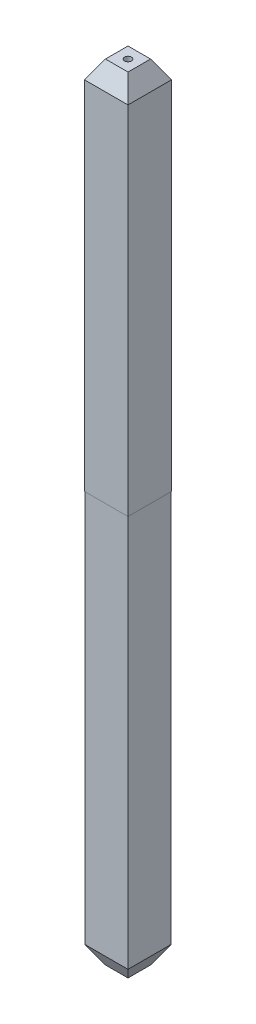
ISO-10303-21;
HEADER;
FILE_DESCRIPTION(('STEP AP214'),'2;1');
FILE_NAME('part.step','',(''),(''),'','','');
FILE_SCHEMA(('AUTOMOTIVE_DESIGN { 1 0 10303 214 1 1 1 1 }'));
ENDSEC;
DATA;
#1=APPLICATION_CONTEXT('core data for automotive mechanical design processes');
#2=APPLICATION_PROTOCOL_DEFINITION('international standard','automotive_design',2000,#1);
#3=PRODUCT_CONTEXT('',#1,'mechanical');
#4=PRODUCT('Part','Part','',(#3));
#5=PRODUCT_RELATED_PRODUCT_CATEGORY('part','',(#4));
#6=PRODUCT_DEFINITION_FORMATION('','',#4);
#7=PRODUCT_DEFINITION_CONTEXT('part definition',#1,'design');
#8=PRODUCT_DEFINITION('design','',#6,#7);
#9=PRODUCT_DEFINITION_SHAPE('','',#8);
#10=(LENGTH_UNIT() NAMED_UNIT(*) SI_UNIT(.MILLI.,.METRE.));
#11=(NAMED_UNIT(*) PLANE_ANGLE_UNIT() SI_UNIT($,.RADIAN.));
#12=(NAMED_UNIT(*) SI_UNIT($,.STERADIAN.) SOLID_ANGLE_UNIT());
#13=UNCERTAINTY_MEASURE_WITH_UNIT(LENGTH_MEASURE(1.E-05),#10,'distance_accuracy_value','');
#14=(GEOMETRIC_REPRESENTATION_CONTEXT(3) GLOBAL_UNCERTAINTY_ASSIGNED_CONTEXT((#13)) GLOBAL_UNIT_ASSIGNED_CONTEXT((#10,
#11,#12)) REPRESENTATION_CONTEXT('',''));
#15=CARTESIAN_POINT('',(0.,0.,0.));
#16=DIRECTION('',(0.,0.,1.));
#17=DIRECTION('',(1.,0.,0.));
#18=AXIS2_PLACEMENT_3D('',#15,#16,#17);
#19=CARTESIAN_POINT('',(-0.0766003527351416,-0.5,0.0186429872590637));
#20=DIRECTION('',(0.,1.,0.));
#21=DIRECTION('',(-1.,0.,0.));
#22=AXIS2_PLACEMENT_3D('',#19,#20,#21);
#23=PLANE('',#22);
#24=CARTESIAN_POINT('',(0.,-0.5,0.));
#25=DIRECTION('',(0.,1.,0.));
#26=DIRECTION('',(-1.,0.,0.));
#27=AXIS2_PLACEMENT_3D('',#24,#25,#26);
#28=CIRCLE('',#27,0.05);
#29=CARTESIAN_POINT('',(-0.05,-0.5,0.));
#30=VERTEX_POINT('',#29);
#31=EDGE_CURVE('E20',#30,#30,#28,.T.);
#32=ORIENTED_EDGE('',*,*,#31,.T.);
#33=EDGE_LOOP('',(#32));
#34=FACE_BOUND('',#33,.T.);
#35=ADVANCED_FACE('F17',(#34),#23,.T.);
#36=CARTESIAN_POINT('',(0.,0.,0.));
#37=DIRECTION('',(0.,1.,0.));
#38=DIRECTION('',(-1.,0.,0.));
#39=AXIS2_PLACEMENT_3D('',#36,#37,#38);
#40=CYLINDRICAL_SURFACE('',#39,0.05);
#41=CARTESIAN_POINT('',(0.,0.,0.));
#42=DIRECTION('',(0.,1.,0.));
#43=DIRECTION('',(-1.,0.,0.));
#44=AXIS2_PLACEMENT_3D('',#41,#42,#43);
#45=CIRCLE('',#44,0.05);
#46=CARTESIAN_POINT('',(-0.05,0.,0.));
#47=VERTEX_POINT('',#46);
#48=EDGE_CURVE('E115',#47,#47,#45,.T.);
#49=ORIENTED_EDGE('',*,*,#48,.T.);
#50=EDGE_LOOP('',(#49));
#51=FACE_BOUND('',#50,.T.);
#52=ORIENTED_EDGE('',*,*,#31,.F.);
#53=EDGE_LOOP('',(#52));
#54=FACE_BOUND('',#53,.T.);
#55=ADVANCED_FACE('F422',(#51,#54),#40,.F.);
#56=CARTESIAN_POINT('',(-0.165,0.,0.3175));
#57=DIRECTION('',(-0.866025403784429,0.500000000000017,0.));
#58=DIRECTION('',(-0.500000000000017,-0.866025403784429,0.));
#59=AXIS2_PLACEMENT_3D('',#56,#57,#58);
#60=PLANE('',#59);
#61=DIRECTION('',(0.,0.,1.));
#62=VECTOR('',#61,1.);
#63=CARTESIAN_POINT('',(-0.3175,-0.2641377481543,0.3175));
#64=LINE('',#63,#62);
#65=CARTESIAN_POINT('',(-0.317500000000013,-0.264137748154289,0.317500000000006));
#66=VERTEX_POINT('',#65);
#67=CARTESIAN_POINT('',(-0.317500000000013,-0.264137748154291,-0.317500000000003));
#68=VERTEX_POINT('',#67);
#69=EDGE_CURVE('E135',#66,#68,#64,.F.);
#70=ORIENTED_EDGE('',*,*,#69,.F.);
#71=DIRECTION('',(-0.447213595499911,-0.774596669241495,0.447213595499985));
#72=VECTOR('',#71,1.);
#73=CARTESIAN_POINT('',(-0.165,0.,0.165));
#74=LINE('',#73,#72);
#75=CARTESIAN_POINT('',(-0.165,0.,0.165));
#76=VERTEX_POINT('',#75);
#77=EDGE_CURVE('E114',#76,#66,#74,.T.);
#78=ORIENTED_EDGE('',*,*,#77,.F.);
#79=DIRECTION('',(0.,0.,-1.));
#80=VECTOR('',#79,1.);
#81=CARTESIAN_POINT('',(-0.165,0.,0.));
#82=LINE('',#81,#80);
#83=CARTESIAN_POINT('',(-0.165,0.,-0.165));
#84=VERTEX_POINT('',#83);
#85=EDGE_CURVE('E104',#76,#84,#82,.T.);
#86=ORIENTED_EDGE('',*,*,#85,.T.);
#87=DIRECTION('',(0.447213595499911,0.774596669241495,0.447213595499985));
#88=VECTOR('',#87,1.);
#89=CARTESIAN_POINT('',(-0.3175,-0.264137748154286,-0.317500000000025));
#90=LINE('',#89,#88);
#91=EDGE_CURVE('E112',#68,#84,#90,.T.);
#92=ORIENTED_EDGE('',*,*,#91,.F.);
#93=EDGE_LOOP('',(#70,#78,#86,#92));
#94=FACE_BOUND('',#93,.T.);
#95=ADVANCED_FACE('F111',(#94),#60,.T.);
#96=CARTESIAN_POINT('',(0.,0.,0.));
#97=DIRECTION('',(0.,-1.,0.));
#98=DIRECTION('',(0.,0.,-1.));
#99=AXIS2_PLACEMENT_3D('',#96,#97,#98);
#100=PLANE('',#99);
#101=ORIENTED_EDGE('',*,*,#48,.F.);
#102=EDGE_LOOP('',(#101));
#103=FACE_BOUND('',#102,.T.);
#104=DIRECTION('',(1.,0.,0.));
#105=VECTOR('',#104,1.);
#106=CARTESIAN_POINT('',(-0.3175,0.,-0.165));
#107=LINE('',#106,#105);
#108=CARTESIAN_POINT('',(0.165,0.,-0.165));
#109=VERTEX_POINT('',#108);
#110=EDGE_CURVE('E120',#84,#109,#107,.T.);
#111=ORIENTED_EDGE('',*,*,#110,.F.);
#112=ORIENTED_EDGE('',*,*,#85,.F.);
#113=DIRECTION('',(1.,0.,0.));
#114=VECTOR('',#113,1.);
#115=CARTESIAN_POINT('',(0.3175,0.,0.165));
#116=LINE('',#115,#114);
#117=CARTESIAN_POINT('',(0.165,0.,0.165));
#118=VERTEX_POINT('',#117);
#119=EDGE_CURVE('E123',#118,#76,#116,.F.);
#120=ORIENTED_EDGE('',*,*,#119,.F.);
#121=DIRECTION('',(0.,0.,1.));
#122=VECTOR('',#121,1.);
#123=CARTESIAN_POINT('',(0.165,0.,-0.3175));
#124=LINE('',#123,#122);
#125=EDGE_CURVE('E127',#109,#118,#124,.T.);
#126=ORIENTED_EDGE('',*,*,#125,.F.);
#127=EDGE_LOOP('',(#111,#112,#120,#126));
#128=FACE_BOUND('',#127,.T.);
#129=ADVANCED_FACE('F126',(#103,#128),#100,.F.);
#130=CARTESIAN_POINT('',(-0.3175,0.,-0.165));
#131=DIRECTION('',(0.,0.500000000000017,-0.866025403784429));
#132=DIRECTION('',(0.,0.866025403784429,0.500000000000017));
#133=AXIS2_PLACEMENT_3D('',#130,#131,#132);
#134=PLANE('',#133);
#135=DIRECTION('',(-1.,0.,0.));
#136=VECTOR('',#135,1.);
#137=CARTESIAN_POINT('',(-0.3175,-0.2641377481543,-0.3175));
#138=LINE('',#137,#136);
#139=CARTESIAN_POINT('',(0.317500000000003,-0.264137748154291,-0.317500000000013));
#140=VERTEX_POINT('',#139);
#141=EDGE_CURVE('E122',#68,#140,#138,.F.);
#142=ORIENTED_EDGE('',*,*,#141,.F.);
#143=ORIENTED_EDGE('',*,*,#91,.T.);
#144=ORIENTED_EDGE('',*,*,#110,.T.);
#145=DIRECTION('',(-0.447213595499985,0.774596669241495,0.447213595499911));
#146=VECTOR('',#145,1.);
#147=CARTESIAN_POINT('',(0.317500000000025,-0.264137748154286,-0.3175));
#148=LINE('',#147,#146);
#149=EDGE_CURVE('E146',#140,#109,#148,.T.);
#150=ORIENTED_EDGE('',*,*,#149,.F.);
#151=EDGE_LOOP('',(#142,#143,#144,#150));
#152=FACE_BOUND('',#151,.T.);
#153=ADVANCED_FACE('F118',(#152),#134,.T.);
#154=CARTESIAN_POINT('',(0.3175,0.,0.165));
#155=DIRECTION('',(0.,0.500000000000017,0.866025403784429));
#156=DIRECTION('',(0.,-0.866025403784429,0.500000000000017));
#157=AXIS2_PLACEMENT_3D('',#154,#155,#156);
#158=PLANE('',#157);
#159=DIRECTION('',(1.,0.,0.));
#160=VECTOR('',#159,1.);
#161=CARTESIAN_POINT('',(0.3175,-0.2641377481543,0.3175));
#162=LINE('',#161,#160);
#163=CARTESIAN_POINT('',(0.317500000000006,-0.264137748154289,0.317500000000013));
#164=VERTEX_POINT('',#163);
#165=EDGE_CURVE('E150',#164,#66,#162,.F.);
#166=ORIENTED_EDGE('',*,*,#165,.F.);
#167=DIRECTION('',(0.447213595499985,-0.774596669241495,0.447213595499911));
#168=VECTOR('',#167,1.);
#169=CARTESIAN_POINT('',(0.165,0.,0.165));
#170=LINE('',#169,#168);
#171=EDGE_CURVE('E144',#118,#164,#170,.T.);
#172=ORIENTED_EDGE('',*,*,#171,.F.);
#173=ORIENTED_EDGE('',*,*,#119,.T.);
#174=ORIENTED_EDGE('',*,*,#77,.T.);
#175=EDGE_LOOP('',(#166,#172,#173,#174));
#176=FACE_BOUND('',#175,.T.);
#177=ADVANCED_FACE('F390',(#176),#158,.T.);
#178=CARTESIAN_POINT('',(-0.3175,0.,0.3175));
#179=DIRECTION('',(-1.,0.,0.));
#180=DIRECTION('',(0.,0.,1.));
#181=AXIS2_PLACEMENT_3D('',#178,#179,#180);
#182=PLANE('',#181);
#183=ORIENTED_EDGE('',*,*,#69,.T.);
#184=DIRECTION('',(0.,1.,0.));
#185=VECTOR('',#184,1.);
#186=CARTESIAN_POINT('',(-0.3175,0.,-0.3175));
#187=LINE('',#186,#185);
#188=CARTESIAN_POINT('',(-0.3175,-5.48,-0.3175));
#189=VERTEX_POINT('',#188);
#190=EDGE_CURVE('E139',#189,#68,#187,.T.);
#191=ORIENTED_EDGE('',*,*,#190,.F.);
#192=DIRECTION('',(0.,0.,1.));
#193=VECTOR('',#192,1.);
#194=CARTESIAN_POINT('',(-0.3175,-5.48,0.3175));
#195=LINE('',#194,#193);
#196=CARTESIAN_POINT('',(-0.3175,-5.48,0.3175));
#197=VERTEX_POINT('',#196);
#198=EDGE_CURVE('E133',#189,#197,#195,.T.);
#199=ORIENTED_EDGE('',*,*,#198,.T.);
#200=DIRECTION('',(0.,1.,0.));
#201=VECTOR('',#200,1.);
#202=CARTESIAN_POINT('',(-0.3175,0.,0.3175));
#203=LINE('',#202,#201);
#204=EDGE_CURVE('E153',#66,#197,#203,.F.);
#205=ORIENTED_EDGE('',*,*,#204,.F.);
#206=EDGE_LOOP('',(#183,#191,#199,#205));
#207=FACE_BOUND('',#206,.T.);
#208=ADVANCED_FACE('F381',(#207),#182,.T.);
#209=CARTESIAN_POINT('',(-0.3175,0.,-0.3175));
#210=DIRECTION('',(0.,0.,-1.));
#211=DIRECTION('',(-1.,0.,0.));
#212=AXIS2_PLACEMENT_3D('',#209,#210,#211);
#213=PLANE('',#212);
#214=ORIENTED_EDGE('',*,*,#141,.T.);
#215=DIRECTION('',(0.,1.,0.));
#216=VECTOR('',#215,1.);
#217=CARTESIAN_POINT('',(0.3175,0.,-0.3175));
#218=LINE('',#217,#216);
#219=CARTESIAN_POINT('',(0.3175,-5.48,-0.3175));
#220=VERTEX_POINT('',#219);
#221=EDGE_CURVE('E164',#220,#140,#218,.T.);
#222=ORIENTED_EDGE('',*,*,#221,.F.);
#223=DIRECTION('',(-1.,0.,0.));
#224=VECTOR('',#223,1.);
#225=CARTESIAN_POINT('',(-0.3175,-5.48,-0.3175));
#226=LINE('',#225,#224);
#227=EDGE_CURVE('E137',#220,#189,#226,.T.);
#228=ORIENTED_EDGE('',*,*,#227,.T.);
#229=ORIENTED_EDGE('',*,*,#190,.T.);
#230=EDGE_LOOP('',(#214,#222,#228,#229));
#231=FACE_BOUND('',#230,.T.);
#232=ADVANCED_FACE('F372',(#231),#213,.T.);
#233=CARTESIAN_POINT('',(0.165,0.,-0.3175));
#234=DIRECTION('',(0.866025403784429,0.500000000000017,0.));
#235=DIRECTION('',(-0.500000000000017,0.866025403784429,0.));
#236=AXIS2_PLACEMENT_3D('',#233,#234,#235);
#237=PLANE('',#236);
#238=DIRECTION('',(0.,0.,-1.));
#239=VECTOR('',#238,1.);
#240=CARTESIAN_POINT('',(0.3175,-0.2641377481543,-0.3175));
#241=LINE('',#240,#239);
#242=EDGE_CURVE('E167',#140,#164,#241,.F.);
#243=ORIENTED_EDGE('',*,*,#242,.F.);
#244=ORIENTED_EDGE('',*,*,#149,.T.);
#245=ORIENTED_EDGE('',*,*,#125,.T.);
#246=ORIENTED_EDGE('',*,*,#171,.T.);
#247=EDGE_LOOP('',(#243,#244,#245,#246));
#248=FACE_BOUND('',#247,.T.);
#249=ADVANCED_FACE('F363',(#248),#237,.T.);
#250=CARTESIAN_POINT('',(0.3175,0.,0.3175));
#251=DIRECTION('',(0.,0.,1.));
#252=DIRECTION('',(1.,0.,0.));
#253=AXIS2_PLACEMENT_3D('',#250,#251,#252);
#254=PLANE('',#253);
#255=ORIENTED_EDGE('',*,*,#165,.T.);
#256=ORIENTED_EDGE('',*,*,#204,.T.);
#257=DIRECTION('',(1.,0.,0.));
#258=VECTOR('',#257,1.);
#259=CARTESIAN_POINT('',(0.3175,-5.48,0.3175));
#260=LINE('',#259,#258);
#261=CARTESIAN_POINT('',(0.3175,-5.48,0.3175));
#262=VERTEX_POINT('',#261);
#263=EDGE_CURVE('E148',#197,#262,#260,.T.);
#264=ORIENTED_EDGE('',*,*,#263,.T.);
#265=DIRECTION('',(0.,1.,0.));
#266=VECTOR('',#265,1.);
#267=CARTESIAN_POINT('',(0.3175,0.,0.3175));
#268=LINE('',#267,#266);
#269=EDGE_CURVE('E170',#164,#262,#268,.F.);
#270=ORIENTED_EDGE('',*,*,#269,.F.);
#271=EDGE_LOOP('',(#255,#256,#264,#270));
#272=FACE_BOUND('',#271,.T.);
#273=ADVANCED_FACE('F354',(#272),#254,.T.);
#274=CARTESIAN_POINT('',(0.3175,-11.48,0.165));
#275=DIRECTION('',(0.,0.500000000000017,-0.866025403784429));
#276=DIRECTION('',(0.,0.866025403784429,0.500000000000017));
#277=AXIS2_PLACEMENT_3D('',#274,#275,#276);
#278=PLANE('',#277);
#279=DIRECTION('',(0.447213595501178,-0.774596669243563,-0.447213595495136));
#280=VECTOR('',#279,1.);
#281=CARTESIAN_POINT('',(-0.315000000002027,-11.2201923788612,0.315));
#282=LINE('',#281,#280);
#283=CARTESIAN_POINT('',(-0.315000000000254,-11.2201923788607,0.315000000001013));
#284=VERTEX_POINT('',#283);
#285=CARTESIAN_POINT('',(-0.165,-11.48,0.165));
#286=VERTEX_POINT('',#285);
#287=EDGE_CURVE('E176',#284,#286,#282,.T.);
#288=ORIENTED_EDGE('',*,*,#287,.T.);
#289=DIRECTION('',(1.,0.,0.));
#290=VECTOR('',#289,1.);
#291=CARTESIAN_POINT('',(0.,-11.48,0.165));
#292=LINE('',#291,#290);
#293=CARTESIAN_POINT('',(0.165,-11.48,0.165));
#294=VERTEX_POINT('',#293);
#295=EDGE_CURVE('E156',#294,#286,#292,.F.);
#296=ORIENTED_EDGE('',*,*,#295,.F.);
#297=DIRECTION('',(0.447213595501178,0.774596669243563,0.447213595495136));
#298=VECTOR('',#297,1.);
#299=CARTESIAN_POINT('',(0.165,-11.48,0.165));
#300=LINE('',#299,#298);
#301=CARTESIAN_POINT('',(0.315000000000507,-11.2201923788609,0.315000000001013));
#302=VERTEX_POINT('',#301);
#303=EDGE_CURVE('E161',#294,#302,#300,.T.);
#304=ORIENTED_EDGE('',*,*,#303,.T.);
#305=DIRECTION('',(-1.,0.,0.));
#306=VECTOR('',#305,1.);
#307=CARTESIAN_POINT('',(0.315,-11.22019237886,0.315));
#308=LINE('',#307,#306);
#309=EDGE_CURVE('E173',#302,#284,#308,.T.);
#310=ORIENTED_EDGE('',*,*,#309,.T.);
#311=EDGE_LOOP('',(#288,#296,#304,#310));
#312=FACE_BOUND('',#311,.T.);
#313=ADVANCED_FACE('F242',(#312),#278,.F.);
#314=CARTESIAN_POINT('',(0.,-11.48,0.));
#315=DIRECTION('',(0.,-1.,0.));
#316=DIRECTION('',(0.,0.,-1.));
#317=AXIS2_PLACEMENT_3D('',#314,#315,#316);
#318=PLANE('',#317);
#319=DIRECTION('',(0.,0.,1.));
#320=VECTOR('',#319,1.);
#321=CARTESIAN_POINT('',(-0.165,-11.48,0.3175));
#322=LINE('',#321,#320);
#323=CARTESIAN_POINT('',(-0.165,-11.48,-0.165));
#324=VERTEX_POINT('',#323);
#325=EDGE_CURVE('E179',#286,#324,#322,.F.);
#326=ORIENTED_EDGE('',*,*,#325,.T.);
#327=DIRECTION('',(1.,0.,0.));
#328=VECTOR('',#327,1.);
#329=CARTESIAN_POINT('',(-0.3175,-11.48,-0.165));
#330=LINE('',#329,#328);
#331=CARTESIAN_POINT('',(0.165,-11.48,-0.165));
#332=VERTEX_POINT('',#331);
#333=EDGE_CURVE('E184',#324,#332,#330,.T.);
#334=ORIENTED_EDGE('',*,*,#333,.T.);
#335=DIRECTION('',(0.,0.,1.));
#336=VECTOR('',#335,1.);
#337=CARTESIAN_POINT('',(0.165,-11.48,-0.3175));
#338=LINE('',#337,#336);
#339=EDGE_CURVE('E158',#332,#294,#338,.T.);
#340=ORIENTED_EDGE('',*,*,#339,.T.);
#341=ORIENTED_EDGE('',*,*,#295,.T.);
#342=EDGE_LOOP('',(#326,#334,#340,#341));
#343=FACE_BOUND('',#342,.T.);
#344=ADVANCED_FACE('F237',(#343),#318,.T.);
#345=CARTESIAN_POINT('',(0.165,-11.48,-0.3175));
#346=DIRECTION('',(-0.866025403784429,0.500000000000017,0.));
#347=DIRECTION('',(-0.500000000000017,-0.866025403784429,0.));
#348=AXIS2_PLACEMENT_3D('',#345,#346,#347);
#349=PLANE('',#348);
#350=ORIENTED_EDGE('',*,*,#303,.F.);
#351=ORIENTED_EDGE('',*,*,#339,.F.);
#352=DIRECTION('',(0.447213595495136,0.774596669243563,-0.447213595501178));
#353=VECTOR('',#352,1.);
#354=CARTESIAN_POINT('',(0.165,-11.48,-0.165));
#355=LINE('',#354,#353);
#356=CARTESIAN_POINT('',(0.315000000001013,-11.2201923788609,-0.315000000000507));
#357=VERTEX_POINT('',#356);
#358=EDGE_CURVE('E187',#332,#357,#355,.T.);
#359=ORIENTED_EDGE('',*,*,#358,.T.);
#360=DIRECTION('',(0.,0.,1.));
#361=VECTOR('',#360,1.);
#362=CARTESIAN_POINT('',(0.315,-11.22019237886,-0.315));
#363=LINE('',#362,#361);
#364=EDGE_CURVE('E190',#357,#302,#363,.T.);
#365=ORIENTED_EDGE('',*,*,#364,.T.);
#366=EDGE_LOOP('',(#350,#351,#359,#365));
#367=FACE_BOUND('',#366,.T.);
#368=ADVANCED_FACE('F232',(#367),#349,.F.);
#369=CARTESIAN_POINT('',(0.3175,0.,-0.3175));
#370=DIRECTION('',(1.,0.,0.));
#371=DIRECTION('',(0.,0.,-1.));
#372=AXIS2_PLACEMENT_3D('',#369,#370,#371);
#373=PLANE('',#372);
#374=ORIENTED_EDGE('',*,*,#242,.T.);
#375=ORIENTED_EDGE('',*,*,#269,.T.);
#376=DIRECTION('',(0.,0.,1.));
#377=VECTOR('',#376,1.);
#378=CARTESIAN_POINT('',(0.3175,-5.48,0.));
#379=LINE('',#378,#377);
#380=EDGE_CURVE('E195',#262,#220,#379,.F.);
#381=ORIENTED_EDGE('',*,*,#380,.T.);
#382=ORIENTED_EDGE('',*,*,#221,.T.);
#383=EDGE_LOOP('',(#374,#375,#381,#382));
#384=FACE_BOUND('',#383,.T.);
#385=ADVANCED_FACE('F248',(#384),#373,.T.);
#386=CARTESIAN_POINT('',(0.315,-11.48,0.315));
#387=DIRECTION('',(0.,0.,-1.));
#388=DIRECTION('',(-1.,0.,0.));
#389=AXIS2_PLACEMENT_3D('',#386,#387,#388);
#390=PLANE('',#389);
#391=DIRECTION('',(1.,0.,0.));
#392=VECTOR('',#391,1.);
#393=CARTESIAN_POINT('',(0.,-5.48,0.315));
#394=LINE('',#393,#392);
#395=CARTESIAN_POINT('',(0.315,-5.48,0.315));
#396=VERTEX_POINT('',#395);
#397=CARTESIAN_POINT('',(-0.315,-5.48,0.315));
#398=VERTEX_POINT('',#397);
#399=EDGE_CURVE('E201',#396,#398,#394,.F.);
#400=ORIENTED_EDGE('',*,*,#399,.T.);
#401=DIRECTION('',(0.,1.,0.));
#402=VECTOR('',#401,1.);
#403=CARTESIAN_POINT('',(-0.315,-11.48,0.315));
#404=LINE('',#403,#402);
#405=EDGE_CURVE('E204',#398,#284,#404,.F.);
#406=ORIENTED_EDGE('',*,*,#405,.T.);
#407=ORIENTED_EDGE('',*,*,#309,.F.);
#408=DIRECTION('',(0.,1.,0.));
#409=VECTOR('',#408,1.);
#410=CARTESIAN_POINT('',(0.315,-11.48,0.315));
#411=LINE('',#410,#409);
#412=EDGE_CURVE('E193',#302,#396,#411,.T.);
#413=ORIENTED_EDGE('',*,*,#412,.T.);
#414=EDGE_LOOP('',(#400,#406,#407,#413));
#415=FACE_BOUND('',#414,.T.);
#416=ADVANCED_FACE('F246',(#415),#390,.F.);
#417=CARTESIAN_POINT('',(-0.165,-11.48,0.3175));
#418=DIRECTION('',(0.866025403784429,0.500000000000017,0.));
#419=DIRECTION('',(-0.500000000000017,0.866025403784429,0.));
#420=AXIS2_PLACEMENT_3D('',#417,#418,#419);
#421=PLANE('',#420);
#422=DIRECTION('',(0.447213595495136,-0.774596669243563,0.447213595501178));
#423=VECTOR('',#422,1.);
#424=CARTESIAN_POINT('',(-0.315,-11.2201923788612,-0.315000000002027));
#425=LINE('',#424,#423);
#426=CARTESIAN_POINT('',(-0.315000000001013,-11.2201923788609,-0.315000000000507));
#427=VERTEX_POINT('',#426);
#428=EDGE_CURVE('E181',#427,#324,#425,.T.);
#429=ORIENTED_EDGE('',*,*,#428,.T.);
#430=ORIENTED_EDGE('',*,*,#325,.F.);
#431=ORIENTED_EDGE('',*,*,#287,.F.);
#432=DIRECTION('',(0.,0.,-1.));
#433=VECTOR('',#432,1.);
#434=CARTESIAN_POINT('',(-0.315,-11.22019237886,0.315));
#435=LINE('',#434,#433);
#436=EDGE_CURVE('E207',#284,#427,#435,.T.);
#437=ORIENTED_EDGE('',*,*,#436,.T.);
#438=EDGE_LOOP('',(#429,#430,#431,#437));
#439=FACE_BOUND('',#438,.T.);
#440=ADVANCED_FACE('F240',(#439),#421,.F.);
#441=CARTESIAN_POINT('',(-0.3175,-11.48,-0.165));
#442=DIRECTION('',(0.,0.500000000000017,0.866025403784429));
#443=DIRECTION('',(0.,-0.866025403784429,0.500000000000017));
#444=AXIS2_PLACEMENT_3D('',#441,#442,#443);
#445=PLANE('',#444);
#446=ORIENTED_EDGE('',*,*,#358,.F.);
#447=ORIENTED_EDGE('',*,*,#333,.F.);
#448=ORIENTED_EDGE('',*,*,#428,.F.);
#449=DIRECTION('',(1.,0.,0.));
#450=VECTOR('',#449,1.);
#451=CARTESIAN_POINT('',(-0.315,-11.22019237886,-0.315));
#452=LINE('',#451,#450);
#453=EDGE_CURVE('E210',#427,#357,#452,.T.);
#454=ORIENTED_EDGE('',*,*,#453,.T.);
#455=EDGE_LOOP('',(#446,#447,#448,#454));
#456=FACE_BOUND('',#455,.T.);
#457=ADVANCED_FACE('F235',(#456),#445,.F.);
#458=CARTESIAN_POINT('',(0.315,-11.48,-0.315));
#459=DIRECTION('',(-1.,0.,0.));
#460=DIRECTION('',(0.,0.,1.));
#461=AXIS2_PLACEMENT_3D('',#458,#459,#460);
#462=PLANE('',#461);
#463=DIRECTION('',(0.,0.,1.));
#464=VECTOR('',#463,1.);
#465=CARTESIAN_POINT('',(0.315,-5.48,0.));
#466=LINE('',#465,#464);
#467=CARTESIAN_POINT('',(0.315,-5.48,-0.315));
#468=VERTEX_POINT('',#467);
#469=EDGE_CURVE('E198',#468,#396,#466,.T.);
#470=ORIENTED_EDGE('',*,*,#469,.T.);
#471=ORIENTED_EDGE('',*,*,#412,.F.);
#472=ORIENTED_EDGE('',*,*,#364,.F.);
#473=DIRECTION('',(0.,1.,0.));
#474=VECTOR('',#473,1.);
#475=CARTESIAN_POINT('',(0.315,-11.48,-0.315));
#476=LINE('',#475,#474);
#477=EDGE_CURVE('E213',#357,#468,#476,.T.);
#478=ORIENTED_EDGE('',*,*,#477,.T.);
#479=EDGE_LOOP('',(#470,#471,#472,#478));
#480=FACE_BOUND('',#479,.T.);
#481=ADVANCED_FACE('F227',(#480),#462,.F.);
#482=CARTESIAN_POINT('',(0.,-5.48,0.));
#483=DIRECTION('',(0.,1.,0.));
#484=DIRECTION('',(0.,0.,1.));
#485=AXIS2_PLACEMENT_3D('',#482,#483,#484);
#486=PLANE('',#485);
#487=DIRECTION('',(0.,0.,-1.));
#488=VECTOR('',#487,1.);
#489=CARTESIAN_POINT('',(-0.315,-5.48,0.315));
#490=LINE('',#489,#488);
#491=CARTESIAN_POINT('',(-0.315,-5.48,-0.315));
#492=VERTEX_POINT('',#491);
#493=EDGE_CURVE('E34',#492,#398,#490,.F.);
#494=ORIENTED_EDGE('',*,*,#493,.T.);
#495=ORIENTED_EDGE('',*,*,#399,.F.);
#496=ORIENTED_EDGE('',*,*,#469,.F.);
#497=DIRECTION('',(1.,0.,0.));
#498=VECTOR('',#497,1.);
#499=CARTESIAN_POINT('',(-0.315,-5.48,-0.315));
#500=LINE('',#499,#498);
#501=EDGE_CURVE('E26',#468,#492,#500,.F.);
#502=ORIENTED_EDGE('',*,*,#501,.T.);
#503=EDGE_LOOP('',(#494,#495,#496,#502));
#504=FACE_BOUND('',#503,.T.);
#505=ORIENTED_EDGE('',*,*,#263,.F.);
#506=ORIENTED_EDGE('',*,*,#198,.F.);
#507=ORIENTED_EDGE('',*,*,#227,.F.);
#508=ORIENTED_EDGE('',*,*,#380,.F.);
#509=EDGE_LOOP('',(#505,#506,#507,#508));
#510=FACE_BOUND('',#509,.T.);
#511=ADVANCED_FACE('F219',(#504,#510),#486,.F.);
#512=CARTESIAN_POINT('',(-0.315,-11.48,0.315));
#513=DIRECTION('',(1.,0.,0.));
#514=DIRECTION('',(0.,0.,-1.));
#515=AXIS2_PLACEMENT_3D('',#512,#513,#514);
#516=PLANE('',#515);
#517=ORIENTED_EDGE('',*,*,#436,.F.);
#518=ORIENTED_EDGE('',*,*,#405,.F.);
#519=ORIENTED_EDGE('',*,*,#493,.F.);
#520=DIRECTION('',(0.,1.,0.));
#521=VECTOR('',#520,1.);
#522=CARTESIAN_POINT('',(-0.315,-11.48,-0.315));
#523=LINE('',#522,#521);
#524=EDGE_CURVE('E11',#492,#427,#523,.F.);
#525=ORIENTED_EDGE('',*,*,#524,.T.);
#526=EDGE_LOOP('',(#517,#518,#519,#525));
#527=FACE_BOUND('',#526,.T.);
#528=ADVANCED_FACE('F245',(#527),#516,.F.);
#529=CARTESIAN_POINT('',(-0.315,-11.48,-0.315));
#530=DIRECTION('',(0.,0.,1.));
#531=DIRECTION('',(1.,0.,0.));
#532=AXIS2_PLACEMENT_3D('',#529,#530,#531);
#533=PLANE('',#532);
#534=ORIENTED_EDGE('',*,*,#501,.F.);
#535=ORIENTED_EDGE('',*,*,#477,.F.);
#536=ORIENTED_EDGE('',*,*,#453,.F.);
#537=ORIENTED_EDGE('',*,*,#524,.F.);
#538=EDGE_LOOP('',(#534,#535,#536,#537));
#539=FACE_BOUND('',#538,.T.);
#540=ADVANCED_FACE('F224',(#539),#533,.F.);
#541=CLOSED_SHELL('',(#35,#55,#95,#129,#153,#177,#208,#232,#249,#273,#313,#344,#368,#385,#416,
#440,#457,#481,#511,#528,#540));
#542=MANIFOLD_SOLID_BREP('B1',#541);
#543=ADVANCED_BREP_SHAPE_REPRESENTATION('',(#18,#542),#14);
#544=SHAPE_DEFINITION_REPRESENTATION(#9,#543);
ENDSEC;
END-ISO-10303-21;
